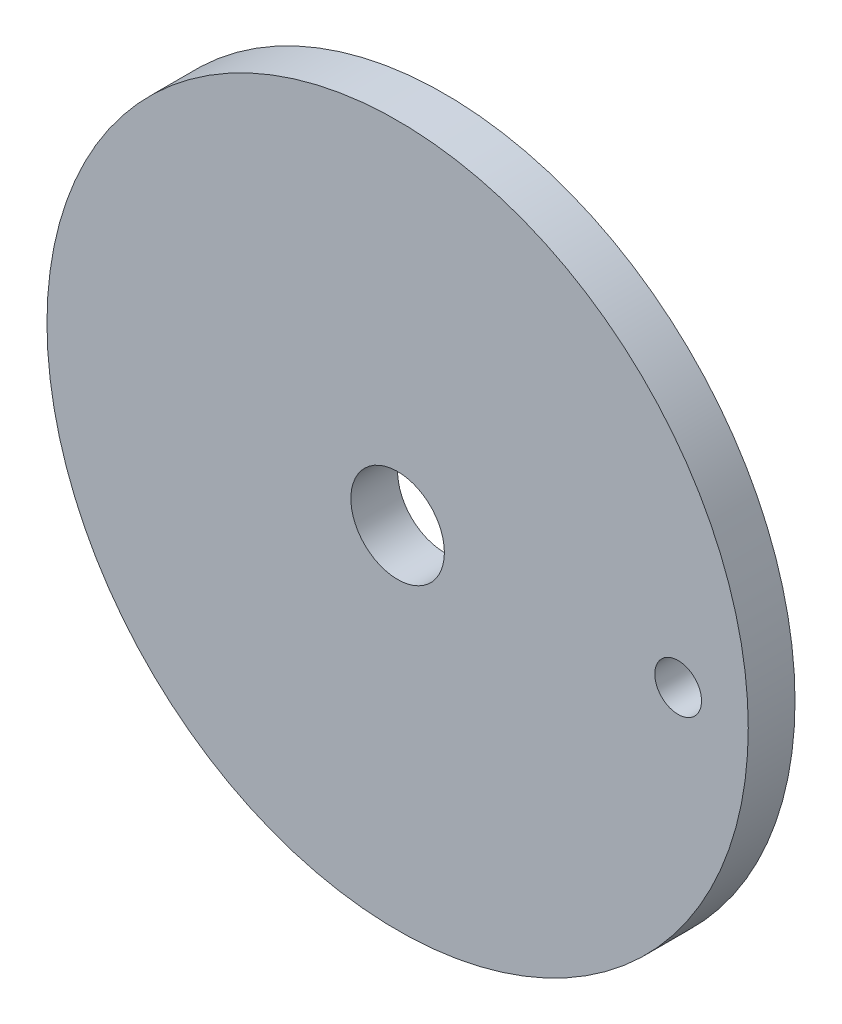
ISO-10303-21;
HEADER;
FILE_DESCRIPTION(('STEP AP214'),'2;1');
FILE_NAME('part.step','',(''),(''),'','','');
FILE_SCHEMA(('AUTOMOTIVE_DESIGN { 1 0 10303 214 1 1 1 1 }'));
ENDSEC;
DATA;
#1=APPLICATION_CONTEXT('core data for automotive mechanical design processes');
#2=APPLICATION_PROTOCOL_DEFINITION('international standard','automotive_design',2000,#1);
#3=PRODUCT_CONTEXT('',#1,'mechanical');
#4=PRODUCT('Part','Part','',(#3));
#5=PRODUCT_RELATED_PRODUCT_CATEGORY('part','',(#4));
#6=PRODUCT_DEFINITION_FORMATION('','',#4);
#7=PRODUCT_DEFINITION_CONTEXT('part definition',#1,'design');
#8=PRODUCT_DEFINITION('design','',#6,#7);
#9=PRODUCT_DEFINITION_SHAPE('','',#8);
#10=(LENGTH_UNIT() NAMED_UNIT(*) SI_UNIT(.MILLI.,.METRE.));
#11=(NAMED_UNIT(*) PLANE_ANGLE_UNIT() SI_UNIT($,.RADIAN.));
#12=(NAMED_UNIT(*) SI_UNIT($,.STERADIAN.) SOLID_ANGLE_UNIT());
#13=UNCERTAINTY_MEASURE_WITH_UNIT(LENGTH_MEASURE(1.E-05),#10,'distance_accuracy_value','');
#14=(GEOMETRIC_REPRESENTATION_CONTEXT(3) GLOBAL_UNCERTAINTY_ASSIGNED_CONTEXT((#13)) GLOBAL_UNIT_ASSIGNED_CONTEXT((#10,
#11,#12)) REPRESENTATION_CONTEXT('',''));
#15=CARTESIAN_POINT('',(0.,0.,0.));
#16=DIRECTION('',(0.,0.,1.));
#17=DIRECTION('',(1.,0.,0.));
#18=AXIS2_PLACEMENT_3D('',#15,#16,#17);
#19=CARTESIAN_POINT('',(0.,0.,16.));
#20=DIRECTION('',(0.,0.,-1.));
#21=DIRECTION('',(-1.,0.,0.));
#22=AXIS2_PLACEMENT_3D('',#19,#20,#21);
#23=CYLINDRICAL_SURFACE('',#22,7.5);
#24=CARTESIAN_POINT('',(0.,0.,16.));
#25=DIRECTION('',(0.,0.,1.));
#26=DIRECTION('',(1.,0.,0.));
#27=AXIS2_PLACEMENT_3D('',#24,#25,#26);
#28=CIRCLE('',#27,7.5);
#29=CARTESIAN_POINT('',(7.5,0.,16.));
#30=VERTEX_POINT('',#29);
#31=EDGE_CURVE('E10',#30,#30,#28,.T.);
#32=ORIENTED_EDGE('',*,*,#31,.F.);
#33=EDGE_LOOP('',(#32));
#34=FACE_BOUND('',#33,.T.);
#35=CARTESIAN_POINT('',(0.,0.,15.));
#36=DIRECTION('',(0.,0.,1.));
#37=DIRECTION('',(1.,0.,0.));
#38=AXIS2_PLACEMENT_3D('',#35,#36,#37);
#39=CIRCLE('',#38,7.5);
#40=CARTESIAN_POINT('',(7.5,0.,15.));
#41=VERTEX_POINT('',#40);
#42=EDGE_CURVE('E45',#41,#41,#39,.T.);
#43=ORIENTED_EDGE('',*,*,#42,.T.);
#44=EDGE_LOOP('',(#43));
#45=FACE_BOUND('',#44,.T.);
#46=ADVANCED_FACE('F37',(#34,#45),#23,.T.);
#47=CARTESIAN_POINT('',(0.,0.,16.));
#48=DIRECTION('',(0.,0.,1.));
#49=DIRECTION('',(1.,0.,0.));
#50=AXIS2_PLACEMENT_3D('',#47,#48,#49);
#51=PLANE('',#50);
#52=CARTESIAN_POINT('',(0.,0.,16.));
#53=DIRECTION('',(0.,0.,1.));
#54=DIRECTION('',(1.,0.,0.));
#55=AXIS2_PLACEMENT_3D('',#52,#53,#54);
#56=CIRCLE('',#55,1.);
#57=CARTESIAN_POINT('',(1.,0.,16.));
#58=VERTEX_POINT('',#57);
#59=EDGE_CURVE('E60',#58,#58,#56,.T.);
#60=ORIENTED_EDGE('',*,*,#59,.F.);
#61=EDGE_LOOP('',(#60));
#62=FACE_BOUND('',#61,.T.);
#63=CARTESIAN_POINT('',(6.,0.,16.));
#64=DIRECTION('',(0.,0.,1.));
#65=DIRECTION('',(1.,0.,0.));
#66=AXIS2_PLACEMENT_3D('',#63,#64,#65);
#67=CIRCLE('',#66,0.500000000000001);
#68=CARTESIAN_POINT('',(6.5,0.,16.));
#69=VERTEX_POINT('',#68);
#70=EDGE_CURVE('E52',#69,#69,#67,.T.);
#71=ORIENTED_EDGE('',*,*,#70,.F.);
#72=EDGE_LOOP('',(#71));
#73=FACE_BOUND('',#72,.T.);
#74=ORIENTED_EDGE('',*,*,#31,.T.);
#75=EDGE_LOOP('',(#74));
#76=FACE_BOUND('',#75,.T.);
#77=ADVANCED_FACE('F68',(#62,#73,#76),#51,.T.);
#78=CARTESIAN_POINT('',(0.,0.,15.));
#79=DIRECTION('',(0.,0.,1.));
#80=DIRECTION('',(1.,0.,0.));
#81=AXIS2_PLACEMENT_3D('',#78,#79,#80);
#82=PLANE('',#81);
#83=CARTESIAN_POINT('',(6.,0.,15.));
#84=DIRECTION('',(0.,0.,1.));
#85=DIRECTION('',(1.,0.,0.));
#86=AXIS2_PLACEMENT_3D('',#83,#84,#85);
#87=CIRCLE('',#86,0.500000000000001);
#88=CARTESIAN_POINT('',(6.5,0.,15.));
#89=VERTEX_POINT('',#88);
#90=EDGE_CURVE('E40',#89,#89,#87,.T.);
#91=ORIENTED_EDGE('',*,*,#90,.T.);
#92=EDGE_LOOP('',(#91));
#93=FACE_BOUND('',#92,.T.);
#94=CARTESIAN_POINT('',(0.,0.,15.));
#95=DIRECTION('',(0.,0.,1.));
#96=DIRECTION('',(1.,0.,0.));
#97=AXIS2_PLACEMENT_3D('',#94,#95,#96);
#98=CIRCLE('',#97,1.);
#99=CARTESIAN_POINT('',(1.,0.,15.));
#100=VERTEX_POINT('',#99);
#101=EDGE_CURVE('E56',#100,#100,#98,.T.);
#102=ORIENTED_EDGE('',*,*,#101,.T.);
#103=EDGE_LOOP('',(#102));
#104=FACE_BOUND('',#103,.T.);
#105=ORIENTED_EDGE('',*,*,#42,.F.);
#106=EDGE_LOOP('',(#105));
#107=FACE_BOUND('',#106,.T.);
#108=ADVANCED_FACE('F71',(#93,#104,#107),#82,.F.);
#109=CARTESIAN_POINT('',(6.,0.,6.));
#110=DIRECTION('',(0.,0.,1.));
#111=DIRECTION('',(1.,0.,0.));
#112=AXIS2_PLACEMENT_3D('',#109,#110,#111);
#113=CYLINDRICAL_SURFACE('',#112,0.500000000000001);
#114=ORIENTED_EDGE('',*,*,#70,.T.);
#115=EDGE_LOOP('',(#114));
#116=FACE_BOUND('',#115,.T.);
#117=ORIENTED_EDGE('',*,*,#90,.F.);
#118=EDGE_LOOP('',(#117));
#119=FACE_BOUND('',#118,.T.);
#120=ADVANCED_FACE('F75',(#116,#119),#113,.F.);
#121=CARTESIAN_POINT('',(0.,0.,-4.));
#122=DIRECTION('',(0.,0.,1.));
#123=DIRECTION('',(1.,0.,0.));
#124=AXIS2_PLACEMENT_3D('',#121,#122,#123);
#125=CYLINDRICAL_SURFACE('',#124,1.);
#126=ORIENTED_EDGE('',*,*,#59,.T.);
#127=EDGE_LOOP('',(#126));
#128=FACE_BOUND('',#127,.T.);
#129=ORIENTED_EDGE('',*,*,#101,.F.);
#130=EDGE_LOOP('',(#129));
#131=FACE_BOUND('',#130,.T.);
#132=ADVANCED_FACE('F65',(#128,#131),#125,.F.);
#133=CLOSED_SHELL('',(#46,#77,#108,#120,#132));
#134=MANIFOLD_SOLID_BREP('B2',#133);
#135=ADVANCED_BREP_SHAPE_REPRESENTATION('',(#18,#134),#14);
#136=SHAPE_DEFINITION_REPRESENTATION(#9,#135);
ENDSEC;
END-ISO-10303-21;
